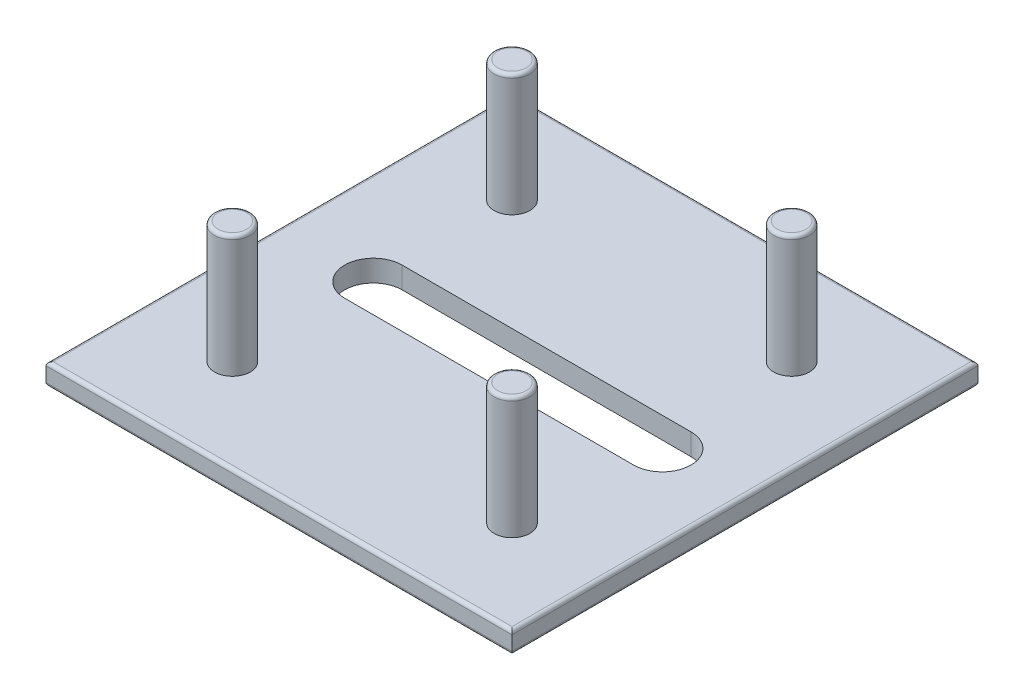
ISO-10303-21;
HEADER;
FILE_DESCRIPTION(('STEP AP214'),'2;1');
FILE_NAME('part.step','',(''),(''),'','','');
FILE_SCHEMA(('AUTOMOTIVE_DESIGN { 1 0 10303 214 1 1 1 1 }'));
ENDSEC;
DATA;
#1=APPLICATION_CONTEXT('core data for automotive mechanical design processes');
#2=APPLICATION_PROTOCOL_DEFINITION('international standard','automotive_design',2000,#1);
#3=PRODUCT_CONTEXT('',#1,'mechanical');
#4=PRODUCT('Part','Part','',(#3));
#5=PRODUCT_RELATED_PRODUCT_CATEGORY('part','',(#4));
#6=PRODUCT_DEFINITION_FORMATION('','',#4);
#7=PRODUCT_DEFINITION_CONTEXT('part definition',#1,'design');
#8=PRODUCT_DEFINITION('design','',#6,#7);
#9=PRODUCT_DEFINITION_SHAPE('','',#8);
#10=(LENGTH_UNIT() NAMED_UNIT(*) SI_UNIT(.MILLI.,.METRE.));
#11=(NAMED_UNIT(*) PLANE_ANGLE_UNIT() SI_UNIT($,.RADIAN.));
#12=(NAMED_UNIT(*) SI_UNIT($,.STERADIAN.) SOLID_ANGLE_UNIT());
#13=UNCERTAINTY_MEASURE_WITH_UNIT(LENGTH_MEASURE(1.E-05),#10,'distance_accuracy_value','');
#14=(GEOMETRIC_REPRESENTATION_CONTEXT(3) GLOBAL_UNCERTAINTY_ASSIGNED_CONTEXT((#13)) GLOBAL_UNIT_ASSIGNED_CONTEXT((#10,
#11,#12)) REPRESENTATION_CONTEXT('',''));
#15=CARTESIAN_POINT('',(0.,0.,0.));
#16=DIRECTION('',(0.,0.,1.));
#17=DIRECTION('',(1.,0.,0.));
#18=AXIS2_PLACEMENT_3D('',#15,#16,#17);
#19=CARTESIAN_POINT('',(32.5,3.,-32.5));
#20=DIRECTION('',(-1.,0.,0.));
#21=DIRECTION('',(0.,0.,1.));
#22=AXIS2_PLACEMENT_3D('',#19,#20,#21);
#23=PLANE('',#22);
#24=DIRECTION('',(0.,-1.,0.));
#25=VECTOR('',#24,1.);
#26=CARTESIAN_POINT('',(32.5,3.,-32.5));
#27=LINE('',#26,#25);
#28=CARTESIAN_POINT('',(32.5,2.5,-32.5));
#29=VERTEX_POINT('',#28);
#30=CARTESIAN_POINT('',(32.5,0.5,-32.5));
#31=VERTEX_POINT('',#30);
#32=EDGE_CURVE('E215',#29,#31,#27,.T.);
#33=ORIENTED_EDGE('',*,*,#32,.F.);
#34=DIRECTION('',(0.,0.,-1.));
#35=VECTOR('',#34,1.);
#36=CARTESIAN_POINT('',(32.5,2.5,32.5));
#37=LINE('',#36,#35);
#38=CARTESIAN_POINT('',(32.5,2.5,32.5));
#39=VERTEX_POINT('',#38);
#40=EDGE_CURVE('E267',#29,#39,#37,.F.);
#41=ORIENTED_EDGE('',*,*,#40,.T.);
#42=DIRECTION('',(0.,-1.,0.));
#43=VECTOR('',#42,1.);
#44=CARTESIAN_POINT('',(32.5,3.,32.5));
#45=LINE('',#44,#43);
#46=CARTESIAN_POINT('',(32.5,0.5,32.5));
#47=VERTEX_POINT('',#46);
#48=EDGE_CURVE('E203',#39,#47,#45,.T.);
#49=ORIENTED_EDGE('',*,*,#48,.T.);
#50=DIRECTION('',(0.,0.,-1.));
#51=VECTOR('',#50,1.);
#52=CARTESIAN_POINT('',(32.5,0.5,-32.5));
#53=LINE('',#52,#51);
#54=EDGE_CURVE('E264',#47,#31,#53,.T.);
#55=ORIENTED_EDGE('',*,*,#54,.T.);
#56=EDGE_LOOP('',(#33,#41,#49,#55));
#57=FACE_BOUND('',#56,.T.);
#58=ADVANCED_FACE('F43',(#57),#23,.F.);
#59=CARTESIAN_POINT('',(-32.5,3.,-32.5));
#60=DIRECTION('',(0.,0.,1.));
#61=DIRECTION('',(1.,0.,0.));
#62=AXIS2_PLACEMENT_3D('',#59,#60,#61);
#63=PLANE('',#62);
#64=DIRECTION('',(0.,-1.,0.));
#65=VECTOR('',#64,1.);
#66=CARTESIAN_POINT('',(-32.5,3.,-32.5));
#67=LINE('',#66,#65);
#68=CARTESIAN_POINT('',(-32.5,2.5,-32.5));
#69=VERTEX_POINT('',#68);
#70=CARTESIAN_POINT('',(-32.5,0.5,-32.5));
#71=VERTEX_POINT('',#70);
#72=EDGE_CURVE('E211',#69,#71,#67,.T.);
#73=ORIENTED_EDGE('',*,*,#72,.F.);
#74=DIRECTION('',(-1.,0.,0.));
#75=VECTOR('',#74,1.);
#76=CARTESIAN_POINT('',(32.5,2.5,-32.5));
#77=LINE('',#76,#75);
#78=EDGE_CURVE('E275',#69,#29,#77,.F.);
#79=ORIENTED_EDGE('',*,*,#78,.T.);
#80=ORIENTED_EDGE('',*,*,#32,.T.);
#81=DIRECTION('',(-1.,0.,0.));
#82=VECTOR('',#81,1.);
#83=CARTESIAN_POINT('',(-32.5,0.5,-32.5));
#84=LINE('',#83,#82);
#85=EDGE_CURVE('E271',#31,#71,#84,.T.);
#86=ORIENTED_EDGE('',*,*,#85,.T.);
#87=EDGE_LOOP('',(#73,#79,#80,#86));
#88=FACE_BOUND('',#87,.T.);
#89=ADVANCED_FACE('F338',(#88),#63,.F.);
#90=CARTESIAN_POINT('',(-32.5,3.,-32.5));
#91=DIRECTION('',(1.,0.,0.));
#92=DIRECTION('',(0.,0.,-1.));
#93=AXIS2_PLACEMENT_3D('',#90,#91,#92);
#94=PLANE('',#93);
#95=DIRECTION('',(0.,-1.,0.));
#96=VECTOR('',#95,1.);
#97=CARTESIAN_POINT('',(-32.5,3.,32.5));
#98=LINE('',#97,#96);
#99=CARTESIAN_POINT('',(-32.5,2.5,32.5));
#100=VERTEX_POINT('',#99);
#101=CARTESIAN_POINT('',(-32.5,0.5,32.5));
#102=VERTEX_POINT('',#101);
#103=EDGE_CURVE('E207',#100,#102,#98,.T.);
#104=ORIENTED_EDGE('',*,*,#103,.F.);
#105=DIRECTION('',(0.,0.,1.));
#106=VECTOR('',#105,1.);
#107=CARTESIAN_POINT('',(-32.5,2.5,-32.5));
#108=LINE('',#107,#106);
#109=EDGE_CURVE('E287',#100,#69,#108,.F.);
#110=ORIENTED_EDGE('',*,*,#109,.T.);
#111=ORIENTED_EDGE('',*,*,#72,.T.);
#112=DIRECTION('',(0.,0.,1.));
#113=VECTOR('',#112,1.);
#114=CARTESIAN_POINT('',(-32.5,0.5,-32.5));
#115=LINE('',#114,#113);
#116=EDGE_CURVE('E284',#71,#102,#115,.T.);
#117=ORIENTED_EDGE('',*,*,#116,.T.);
#118=EDGE_LOOP('',(#104,#110,#111,#117));
#119=FACE_BOUND('',#118,.T.);
#120=ADVANCED_FACE('F341',(#119),#94,.F.);
#121=CARTESIAN_POINT('',(-32.5,3.,32.5));
#122=DIRECTION('',(0.,0.,-1.));
#123=DIRECTION('',(-1.,0.,0.));
#124=AXIS2_PLACEMENT_3D('',#121,#122,#123);
#125=PLANE('',#124);
#126=ORIENTED_EDGE('',*,*,#48,.F.);
#127=DIRECTION('',(1.,0.,0.));
#128=VECTOR('',#127,1.);
#129=CARTESIAN_POINT('',(-32.5,2.5,32.5));
#130=LINE('',#129,#128);
#131=EDGE_CURVE('E281',#39,#100,#130,.F.);
#132=ORIENTED_EDGE('',*,*,#131,.T.);
#133=ORIENTED_EDGE('',*,*,#103,.T.);
#134=DIRECTION('',(1.,0.,0.));
#135=VECTOR('',#134,1.);
#136=CARTESIAN_POINT('',(-32.5,0.5,32.5));
#137=LINE('',#136,#135);
#138=EDGE_CURVE('E278',#102,#47,#137,.T.);
#139=ORIENTED_EDGE('',*,*,#138,.T.);
#140=EDGE_LOOP('',(#126,#132,#133,#139));
#141=FACE_BOUND('',#140,.T.);
#142=ADVANCED_FACE('F430',(#141),#125,.F.);
#143=CARTESIAN_POINT('',(0.,3.,0.));
#144=DIRECTION('',(0.,1.,0.));
#145=DIRECTION('',(0.,0.,1.));
#146=AXIS2_PLACEMENT_3D('',#143,#144,#145);
#147=PLANE('',#146);
#148=DIRECTION('',(1.,0.,0.));
#149=VECTOR('',#148,1.);
#150=CARTESIAN_POINT('',(32.5,3.,32.));
#151=LINE('',#150,#149);
#152=CARTESIAN_POINT('',(-32.,3.,32.));
#153=VERTEX_POINT('',#152);
#154=CARTESIAN_POINT('',(32.,3.,32.));
#155=VERTEX_POINT('',#154);
#156=EDGE_CURVE('E254',#153,#155,#151,.T.);
#157=ORIENTED_EDGE('',*,*,#156,.T.);
#158=DIRECTION('',(0.,0.,-1.));
#159=VECTOR('',#158,1.);
#160=CARTESIAN_POINT('',(32.,3.,-32.5));
#161=LINE('',#160,#159);
#162=CARTESIAN_POINT('',(32.,3.,-32.));
#163=VERTEX_POINT('',#162);
#164=EDGE_CURVE('E260',#155,#163,#161,.T.);
#165=ORIENTED_EDGE('',*,*,#164,.T.);
#166=DIRECTION('',(-1.,0.,0.));
#167=VECTOR('',#166,1.);
#168=CARTESIAN_POINT('',(-32.5,3.,-32.));
#169=LINE('',#168,#167);
#170=CARTESIAN_POINT('',(-32.,3.,-32.));
#171=VERTEX_POINT('',#170);
#172=EDGE_CURVE('E257',#163,#171,#169,.T.);
#173=ORIENTED_EDGE('',*,*,#172,.T.);
#174=DIRECTION('',(0.,0.,1.));
#175=VECTOR('',#174,1.);
#176=CARTESIAN_POINT('',(-32.,3.,32.5));
#177=LINE('',#176,#175);
#178=EDGE_CURVE('E251',#171,#153,#177,.T.);
#179=ORIENTED_EDGE('',*,*,#178,.T.);
#180=EDGE_LOOP('',(#157,#165,#173,#179));
#181=FACE_BOUND('',#180,.T.);
#182=CARTESIAN_POINT('',(-19.3358060086028,3.,0.));
#183=DIRECTION('',(0.,1.,0.));
#184=DIRECTION('',(0.,0.,1.));
#185=AXIS2_PLACEMENT_3D('',#182,#183,#184);
#186=CIRCLE('',#185,4.00540236187915);
#187=CARTESIAN_POINT('',(-19.3358060086028,3.,-4.00540236187915));
#188=VERTEX_POINT('',#187);
#189=CARTESIAN_POINT('',(-19.3358060086028,3.,4.00540236187915));
#190=VERTEX_POINT('',#189);
#191=EDGE_CURVE('E184',#188,#190,#186,.T.);
#192=ORIENTED_EDGE('',*,*,#191,.F.);
#193=DIRECTION('',(-1.,0.,0.));
#194=VECTOR('',#193,1.);
#195=CARTESIAN_POINT('',(0.,3.,-4.00540236187915));
#196=LINE('',#195,#194);
#197=CARTESIAN_POINT('',(20.9662409563712,3.,-4.00540236187915));
#198=VERTEX_POINT('',#197);
#199=EDGE_CURVE('E172',#198,#188,#196,.T.);
#200=ORIENTED_EDGE('',*,*,#199,.F.);
#201=CARTESIAN_POINT('',(20.9662409563712,3.,0.));
#202=DIRECTION('',(0.,1.,0.));
#203=DIRECTION('',(0.,0.,1.));
#204=AXIS2_PLACEMENT_3D('',#201,#202,#203);
#205=CIRCLE('',#204,4.00540236187915);
#206=CARTESIAN_POINT('',(20.9662409563712,3.,4.00540236187915));
#207=VERTEX_POINT('',#206);
#208=EDGE_CURVE('E143',#207,#198,#205,.T.);
#209=ORIENTED_EDGE('',*,*,#208,.F.);
#210=DIRECTION('',(1.,0.,0.));
#211=VECTOR('',#210,1.);
#212=CARTESIAN_POINT('',(0.,3.,4.00540236187915));
#213=LINE('',#212,#211);
#214=EDGE_CURVE('E181',#190,#207,#213,.T.);
#215=ORIENTED_EDGE('',*,*,#214,.F.);
#216=EDGE_LOOP('',(#192,#200,#209,#215));
#217=FACE_BOUND('',#216,.T.);
#218=CARTESIAN_POINT('',(19.5,3.,19.5));
#219=DIRECTION('',(0.,1.,0.));
#220=DIRECTION('',(0.,0.,1.));
#221=AXIS2_PLACEMENT_3D('',#218,#219,#220);
#222=CIRCLE('',#221,2.5);
#223=CARTESIAN_POINT('',(19.5,3.,22.));
#224=VERTEX_POINT('',#223);
#225=EDGE_CURVE('E187',#224,#224,#222,.T.);
#226=ORIENTED_EDGE('',*,*,#225,.F.);
#227=EDGE_LOOP('',(#226));
#228=FACE_BOUND('',#227,.T.);
#229=CARTESIAN_POINT('',(-19.5,3.,19.5));
#230=DIRECTION('',(0.,1.,0.));
#231=DIRECTION('',(0.,0.,1.));
#232=AXIS2_PLACEMENT_3D('',#229,#230,#231);
#233=CIRCLE('',#232,2.5);
#234=CARTESIAN_POINT('',(-19.5,3.,22.));
#235=VERTEX_POINT('',#234);
#236=EDGE_CURVE('E191',#235,#235,#233,.T.);
#237=ORIENTED_EDGE('',*,*,#236,.F.);
#238=EDGE_LOOP('',(#237));
#239=FACE_BOUND('',#238,.T.);
#240=CARTESIAN_POINT('',(19.5,3.,-19.5));
#241=DIRECTION('',(0.,1.,0.));
#242=DIRECTION('',(0.,0.,1.));
#243=AXIS2_PLACEMENT_3D('',#240,#241,#242);
#244=CIRCLE('',#243,2.5);
#245=CARTESIAN_POINT('',(19.5,3.,-17.));
#246=VERTEX_POINT('',#245);
#247=EDGE_CURVE('E195',#246,#246,#244,.T.);
#248=ORIENTED_EDGE('',*,*,#247,.F.);
#249=EDGE_LOOP('',(#248));
#250=FACE_BOUND('',#249,.T.);
#251=CARTESIAN_POINT('',(-19.5,3.,-19.5));
#252=DIRECTION('',(0.,1.,0.));
#253=DIRECTION('',(0.,0.,1.));
#254=AXIS2_PLACEMENT_3D('',#251,#252,#253);
#255=CIRCLE('',#254,2.5);
#256=CARTESIAN_POINT('',(-19.5,3.,-17.));
#257=VERTEX_POINT('',#256);
#258=EDGE_CURVE('E199',#257,#257,#255,.T.);
#259=ORIENTED_EDGE('',*,*,#258,.F.);
#260=EDGE_LOOP('',(#259));
#261=FACE_BOUND('',#260,.T.);
#262=ADVANCED_FACE('F355',(#181,#217,#228,#239,#250,#261),#147,.T.);
#263=CARTESIAN_POINT('',(0.,0.,0.));
#264=DIRECTION('',(0.,1.,0.));
#265=DIRECTION('',(0.,0.,1.));
#266=AXIS2_PLACEMENT_3D('',#263,#264,#265);
#267=PLANE('',#266);
#268=DIRECTION('',(0.,0.,1.));
#269=VECTOR('',#268,1.);
#270=CARTESIAN_POINT('',(-32.,0.,0.));
#271=LINE('',#270,#269);
#272=CARTESIAN_POINT('',(-32.,0.,32.));
#273=VERTEX_POINT('',#272);
#274=CARTESIAN_POINT('',(-32.,0.,-32.));
#275=VERTEX_POINT('',#274);
#276=EDGE_CURVE('E290',#273,#275,#271,.F.);
#277=ORIENTED_EDGE('',*,*,#276,.T.);
#278=DIRECTION('',(-1.,0.,0.));
#279=VECTOR('',#278,1.);
#280=CARTESIAN_POINT('',(0.,0.,-32.));
#281=LINE('',#280,#279);
#282=CARTESIAN_POINT('',(32.,0.,-32.));
#283=VERTEX_POINT('',#282);
#284=EDGE_CURVE('E11',#275,#283,#281,.F.);
#285=ORIENTED_EDGE('',*,*,#284,.T.);
#286=DIRECTION('',(0.,0.,-1.));
#287=VECTOR('',#286,1.);
#288=CARTESIAN_POINT('',(32.,0.,0.));
#289=LINE('',#288,#287);
#290=CARTESIAN_POINT('',(32.,0.,32.));
#291=VERTEX_POINT('',#290);
#292=EDGE_CURVE('E53',#283,#291,#289,.F.);
#293=ORIENTED_EDGE('',*,*,#292,.T.);
#294=DIRECTION('',(1.,0.,0.));
#295=VECTOR('',#294,1.);
#296=CARTESIAN_POINT('',(0.,0.,32.));
#297=LINE('',#296,#295);
#298=EDGE_CURVE('E293',#291,#273,#297,.F.);
#299=ORIENTED_EDGE('',*,*,#298,.T.);
#300=EDGE_LOOP('',(#277,#285,#293,#299));
#301=FACE_BOUND('',#300,.T.);
#302=DIRECTION('',(1.,0.,0.));
#303=VECTOR('',#302,1.);
#304=CARTESIAN_POINT('',(-19.3358060086028,0.,-4.00540236187915));
#305=LINE('',#304,#303);
#306=CARTESIAN_POINT('',(-19.3358060086028,0.,-4.00540236187915));
#307=VERTEX_POINT('',#306);
#308=CARTESIAN_POINT('',(20.9662409563712,0.,-4.00540236187915));
#309=VERTEX_POINT('',#308);
#310=EDGE_CURVE('E152',#307,#309,#305,.T.);
#311=ORIENTED_EDGE('',*,*,#310,.F.);
#312=CARTESIAN_POINT('',(-19.3358060086028,0.,0.));
#313=DIRECTION('',(0.,-1.,0.));
#314=DIRECTION('',(0.,0.,-1.));
#315=AXIS2_PLACEMENT_3D('',#312,#313,#314);
#316=CIRCLE('',#315,4.00540236187915);
#317=CARTESIAN_POINT('',(-19.3358060086028,0.,4.00540236187915));
#318=VERTEX_POINT('',#317);
#319=EDGE_CURVE('E158',#318,#307,#316,.T.);
#320=ORIENTED_EDGE('',*,*,#319,.F.);
#321=DIRECTION('',(-1.,0.,0.));
#322=VECTOR('',#321,1.);
#323=CARTESIAN_POINT('',(-19.3358060086028,0.,4.00540236187915));
#324=LINE('',#323,#322);
#325=CARTESIAN_POINT('',(20.9662409563712,0.,4.00540236187915));
#326=VERTEX_POINT('',#325);
#327=EDGE_CURVE('E162',#326,#318,#324,.T.);
#328=ORIENTED_EDGE('',*,*,#327,.F.);
#329=CARTESIAN_POINT('',(20.9662409563712,0.,0.));
#330=DIRECTION('',(0.,-1.,0.));
#331=DIRECTION('',(0.,0.,-1.));
#332=AXIS2_PLACEMENT_3D('',#329,#330,#331);
#333=CIRCLE('',#332,4.00540236187915);
#334=EDGE_CURVE('E140',#309,#326,#333,.T.);
#335=ORIENTED_EDGE('',*,*,#334,.F.);
#336=EDGE_LOOP('',(#311,#320,#328,#335));
#337=FACE_BOUND('',#336,.T.);
#338=ADVANCED_FACE('F160',(#301,#337),#267,.F.);
#339=CARTESIAN_POINT('',(-19.5,20.,-19.5));
#340=DIRECTION('',(0.,-1.,0.));
#341=DIRECTION('',(0.,0.,-1.));
#342=AXIS2_PLACEMENT_3D('',#339,#340,#341);
#343=CYLINDRICAL_SURFACE('',#342,2.5);
#344=CARTESIAN_POINT('',(-19.5,19.5,-19.5));
#345=DIRECTION('',(0.,1.,0.));
#346=DIRECTION('',(0.,0.,1.));
#347=AXIS2_PLACEMENT_3D('',#344,#345,#346);
#348=CIRCLE('',#347,2.5);
#349=CARTESIAN_POINT('',(-19.5,19.5,-17.));
#350=VERTEX_POINT('',#349);
#351=EDGE_CURVE('E239',#350,#350,#348,.F.);
#352=ORIENTED_EDGE('',*,*,#351,.T.);
#353=EDGE_LOOP('',(#352));
#354=FACE_BOUND('',#353,.T.);
#355=ORIENTED_EDGE('',*,*,#258,.T.);
#356=EDGE_LOOP('',(#355));
#357=FACE_BOUND('',#356,.T.);
#358=ADVANCED_FACE('F423',(#354,#357),#343,.T.);
#359=CARTESIAN_POINT('',(-19.5,20.,-19.5));
#360=DIRECTION('',(0.,1.,0.));
#361=DIRECTION('',(0.,0.,1.));
#362=AXIS2_PLACEMENT_3D('',#359,#360,#361);
#363=PLANE('',#362);
#364=CARTESIAN_POINT('',(-19.5,20.,-19.5));
#365=DIRECTION('',(0.,1.,0.));
#366=DIRECTION('',(0.,0.,1.));
#367=AXIS2_PLACEMENT_3D('',#364,#365,#366);
#368=CIRCLE('',#367,2.);
#369=CARTESIAN_POINT('',(-19.5,20.,-17.5));
#370=VERTEX_POINT('',#369);
#371=EDGE_CURVE('E235',#370,#370,#368,.T.);
#372=ORIENTED_EDGE('',*,*,#371,.T.);
#373=EDGE_LOOP('',(#372));
#374=FACE_BOUND('',#373,.T.);
#375=ADVANCED_FACE('F416',(#374),#363,.T.);
#376=CARTESIAN_POINT('',(19.5,20.,-19.5));
#377=DIRECTION('',(0.,-1.,0.));
#378=DIRECTION('',(0.,0.,-1.));
#379=AXIS2_PLACEMENT_3D('',#376,#377,#378);
#380=CYLINDRICAL_SURFACE('',#379,2.5);
#381=CARTESIAN_POINT('',(19.5,19.5,-19.5));
#382=DIRECTION('',(0.,1.,0.));
#383=DIRECTION('',(0.,0.,1.));
#384=AXIS2_PLACEMENT_3D('',#381,#382,#383);
#385=CIRCLE('',#384,2.5);
#386=CARTESIAN_POINT('',(19.5,19.5,-17.));
#387=VERTEX_POINT('',#386);
#388=EDGE_CURVE('E247',#387,#387,#385,.F.);
#389=ORIENTED_EDGE('',*,*,#388,.T.);
#390=EDGE_LOOP('',(#389));
#391=FACE_BOUND('',#390,.T.);
#392=ORIENTED_EDGE('',*,*,#247,.T.);
#393=EDGE_LOOP('',(#392));
#394=FACE_BOUND('',#393,.T.);
#395=ADVANCED_FACE('F407',(#391,#394),#380,.T.);
#396=CARTESIAN_POINT('',(19.5,20.,-19.5));
#397=DIRECTION('',(0.,1.,0.));
#398=DIRECTION('',(0.,0.,1.));
#399=AXIS2_PLACEMENT_3D('',#396,#397,#398);
#400=PLANE('',#399);
#401=CARTESIAN_POINT('',(19.5,20.,-19.5));
#402=DIRECTION('',(0.,1.,0.));
#403=DIRECTION('',(0.,0.,1.));
#404=AXIS2_PLACEMENT_3D('',#401,#402,#403);
#405=CIRCLE('',#404,2.);
#406=CARTESIAN_POINT('',(19.5,20.,-17.5));
#407=VERTEX_POINT('',#406);
#408=EDGE_CURVE('E243',#407,#407,#405,.T.);
#409=ORIENTED_EDGE('',*,*,#408,.T.);
#410=EDGE_LOOP('',(#409));
#411=FACE_BOUND('',#410,.T.);
#412=ADVANCED_FACE('F404',(#411),#400,.T.);
#413=CARTESIAN_POINT('',(-19.5,20.,19.5));
#414=DIRECTION('',(0.,-1.,0.));
#415=DIRECTION('',(0.,0.,-1.));
#416=AXIS2_PLACEMENT_3D('',#413,#414,#415);
#417=CYLINDRICAL_SURFACE('',#416,2.5);
#418=CARTESIAN_POINT('',(-19.5,19.5,19.5));
#419=DIRECTION('',(0.,1.,0.));
#420=DIRECTION('',(0.,0.,1.));
#421=AXIS2_PLACEMENT_3D('',#418,#419,#420);
#422=CIRCLE('',#421,2.5);
#423=CARTESIAN_POINT('',(-19.5,19.5,22.));
#424=VERTEX_POINT('',#423);
#425=EDGE_CURVE('E231',#424,#424,#422,.F.);
#426=ORIENTED_EDGE('',*,*,#425,.T.);
#427=EDGE_LOOP('',(#426));
#428=FACE_BOUND('',#427,.T.);
#429=ORIENTED_EDGE('',*,*,#236,.T.);
#430=EDGE_LOOP('',(#429));
#431=FACE_BOUND('',#430,.T.);
#432=ADVANCED_FACE('F406',(#428,#431),#417,.T.);
#433=CARTESIAN_POINT('',(-19.5,20.,19.5));
#434=DIRECTION('',(0.,1.,0.));
#435=DIRECTION('',(0.,0.,1.));
#436=AXIS2_PLACEMENT_3D('',#433,#434,#435);
#437=PLANE('',#436);
#438=CARTESIAN_POINT('',(-19.5,20.,19.5));
#439=DIRECTION('',(0.,1.,0.));
#440=DIRECTION('',(0.,0.,1.));
#441=AXIS2_PLACEMENT_3D('',#438,#439,#440);
#442=CIRCLE('',#441,2.);
#443=CARTESIAN_POINT('',(-19.5,20.,21.5));
#444=VERTEX_POINT('',#443);
#445=EDGE_CURVE('E227',#444,#444,#442,.T.);
#446=ORIENTED_EDGE('',*,*,#445,.T.);
#447=EDGE_LOOP('',(#446));
#448=FACE_BOUND('',#447,.T.);
#449=ADVANCED_FACE('F413',(#448),#437,.T.);
#450=CARTESIAN_POINT('',(19.5,20.,19.5));
#451=DIRECTION('',(0.,-1.,0.));
#452=DIRECTION('',(0.,0.,-1.));
#453=AXIS2_PLACEMENT_3D('',#450,#451,#452);
#454=CYLINDRICAL_SURFACE('',#453,2.5);
#455=CARTESIAN_POINT('',(19.5,19.5,19.5));
#456=DIRECTION('',(0.,1.,0.));
#457=DIRECTION('',(0.,0.,1.));
#458=AXIS2_PLACEMENT_3D('',#455,#456,#457);
#459=CIRCLE('',#458,2.5);
#460=CARTESIAN_POINT('',(19.5,19.5,22.));
#461=VERTEX_POINT('',#460);
#462=EDGE_CURVE('E223',#461,#461,#459,.F.);
#463=ORIENTED_EDGE('',*,*,#462,.T.);
#464=EDGE_LOOP('',(#463));
#465=FACE_BOUND('',#464,.T.);
#466=ORIENTED_EDGE('',*,*,#225,.T.);
#467=EDGE_LOOP('',(#466));
#468=FACE_BOUND('',#467,.T.);
#469=ADVANCED_FACE('F486',(#465,#468),#454,.T.);
#470=CARTESIAN_POINT('',(19.5,20.,19.5));
#471=DIRECTION('',(0.,1.,0.));
#472=DIRECTION('',(0.,0.,1.));
#473=AXIS2_PLACEMENT_3D('',#470,#471,#472);
#474=PLANE('',#473);
#475=CARTESIAN_POINT('',(19.5,20.,19.5));
#476=DIRECTION('',(0.,1.,0.));
#477=DIRECTION('',(0.,0.,1.));
#478=AXIS2_PLACEMENT_3D('',#475,#476,#477);
#479=CIRCLE('',#478,2.);
#480=CARTESIAN_POINT('',(19.5,20.,21.5));
#481=VERTEX_POINT('',#480);
#482=EDGE_CURVE('E219',#481,#481,#479,.T.);
#483=ORIENTED_EDGE('',*,*,#482,.T.);
#484=EDGE_LOOP('',(#483));
#485=FACE_BOUND('',#484,.T.);
#486=ADVANCED_FACE('F496',(#485),#474,.T.);
#487=CARTESIAN_POINT('',(-19.3358060086028,20.,0.));
#488=DIRECTION('',(0.,-1.,0.));
#489=DIRECTION('',(0.,0.,-1.));
#490=AXIS2_PLACEMENT_3D('',#487,#488,#489);
#491=CYLINDRICAL_SURFACE('',#490,4.00540236187915);
#492=ORIENTED_EDGE('',*,*,#191,.T.);
#493=DIRECTION('',(0.,-1.,0.));
#494=VECTOR('',#493,1.);
#495=CARTESIAN_POINT('',(-19.3358060086028,20.,4.00540236187915));
#496=LINE('',#495,#494);
#497=EDGE_CURVE('E169',#190,#318,#496,.T.);
#498=ORIENTED_EDGE('',*,*,#497,.T.);
#499=ORIENTED_EDGE('',*,*,#319,.T.);
#500=DIRECTION('',(0.,-1.,0.));
#501=VECTOR('',#500,1.);
#502=CARTESIAN_POINT('',(-19.3358060086028,20.,-4.00540236187915));
#503=LINE('',#502,#501);
#504=EDGE_CURVE('E148',#188,#307,#503,.T.);
#505=ORIENTED_EDGE('',*,*,#504,.F.);
#506=EDGE_LOOP('',(#492,#498,#499,#505));
#507=FACE_BOUND('',#506,.T.);
#508=ADVANCED_FACE('F507',(#507),#491,.F.);
#509=CARTESIAN_POINT('',(-19.3358060086028,20.,4.00540236187915));
#510=DIRECTION('',(0.,0.,1.));
#511=DIRECTION('',(1.,0.,0.));
#512=AXIS2_PLACEMENT_3D('',#509,#510,#511);
#513=PLANE('',#512);
#514=ORIENTED_EDGE('',*,*,#214,.T.);
#515=DIRECTION('',(0.,-1.,0.));
#516=VECTOR('',#515,1.);
#517=CARTESIAN_POINT('',(20.9662409563712,20.,4.00540236187915));
#518=LINE('',#517,#516);
#519=EDGE_CURVE('E147',#207,#326,#518,.T.);
#520=ORIENTED_EDGE('',*,*,#519,.T.);
#521=ORIENTED_EDGE('',*,*,#327,.T.);
#522=ORIENTED_EDGE('',*,*,#497,.F.);
#523=EDGE_LOOP('',(#514,#520,#521,#522));
#524=FACE_BOUND('',#523,.T.);
#525=ADVANCED_FACE('F627',(#524),#513,.F.);
#526=CARTESIAN_POINT('',(20.9662409563712,20.,0.));
#527=DIRECTION('',(0.,-1.,0.));
#528=DIRECTION('',(0.,0.,-1.));
#529=AXIS2_PLACEMENT_3D('',#526,#527,#528);
#530=CYLINDRICAL_SURFACE('',#529,4.00540236187915);
#531=ORIENTED_EDGE('',*,*,#208,.T.);
#532=DIRECTION('',(0.,-1.,0.));
#533=VECTOR('',#532,1.);
#534=CARTESIAN_POINT('',(20.9662409563712,20.,-4.00540236187915));
#535=LINE('',#534,#533);
#536=EDGE_CURVE('E135',#198,#309,#535,.T.);
#537=ORIENTED_EDGE('',*,*,#536,.T.);
#538=ORIENTED_EDGE('',*,*,#334,.T.);
#539=ORIENTED_EDGE('',*,*,#519,.F.);
#540=EDGE_LOOP('',(#531,#537,#538,#539));
#541=FACE_BOUND('',#540,.T.);
#542=ADVANCED_FACE('F137',(#541),#530,.F.);
#543=CARTESIAN_POINT('',(-19.3358060086028,20.,-4.00540236187915));
#544=DIRECTION('',(0.,0.,-1.));
#545=DIRECTION('',(-1.,0.,0.));
#546=AXIS2_PLACEMENT_3D('',#543,#544,#545);
#547=PLANE('',#546);
#548=ORIENTED_EDGE('',*,*,#199,.T.);
#549=ORIENTED_EDGE('',*,*,#504,.T.);
#550=ORIENTED_EDGE('',*,*,#310,.T.);
#551=ORIENTED_EDGE('',*,*,#536,.F.);
#552=EDGE_LOOP('',(#548,#549,#550,#551));
#553=FACE_BOUND('',#552,.T.);
#554=ADVANCED_FACE('F153',(#553),#547,.F.);
#555=CARTESIAN_POINT('',(19.5,19.5,19.5));
#556=DIRECTION('',(0.,1.,0.));
#557=DIRECTION('',(0.,0.,1.));
#558=AXIS2_PLACEMENT_3D('',#555,#556,#557);
#559=TOROIDAL_SURFACE('',#558,2.,0.5);
#560=ORIENTED_EDGE('',*,*,#462,.F.);
#561=EDGE_LOOP('',(#560));
#562=FACE_BOUND('',#561,.T.);
#563=ORIENTED_EDGE('',*,*,#482,.F.);
#564=EDGE_LOOP('',(#563));
#565=FACE_BOUND('',#564,.T.);
#566=ADVANCED_FACE('F382',(#562,#565),#559,.T.);
#567=CARTESIAN_POINT('',(-19.5,19.5,19.5));
#568=DIRECTION('',(0.,1.,0.));
#569=DIRECTION('',(0.,0.,1.));
#570=AXIS2_PLACEMENT_3D('',#567,#568,#569);
#571=TOROIDAL_SURFACE('',#570,2.,0.5);
#572=ORIENTED_EDGE('',*,*,#425,.F.);
#573=EDGE_LOOP('',(#572));
#574=FACE_BOUND('',#573,.T.);
#575=ORIENTED_EDGE('',*,*,#445,.F.);
#576=EDGE_LOOP('',(#575));
#577=FACE_BOUND('',#576,.T.);
#578=ADVANCED_FACE('F385',(#574,#577),#571,.T.);
#579=CARTESIAN_POINT('',(-19.5,19.5,-19.5));
#580=DIRECTION('',(0.,1.,0.));
#581=DIRECTION('',(0.,0.,1.));
#582=AXIS2_PLACEMENT_3D('',#579,#580,#581);
#583=TOROIDAL_SURFACE('',#582,2.,0.5);
#584=ORIENTED_EDGE('',*,*,#351,.F.);
#585=EDGE_LOOP('',(#584));
#586=FACE_BOUND('',#585,.T.);
#587=ORIENTED_EDGE('',*,*,#371,.F.);
#588=EDGE_LOOP('',(#587));
#589=FACE_BOUND('',#588,.T.);
#590=ADVANCED_FACE('F389',(#586,#589),#583,.T.);
#591=CARTESIAN_POINT('',(19.5,19.5,-19.5));
#592=DIRECTION('',(0.,1.,0.));
#593=DIRECTION('',(0.,0.,1.));
#594=AXIS2_PLACEMENT_3D('',#591,#592,#593);
#595=TOROIDAL_SURFACE('',#594,2.,0.5);
#596=ORIENTED_EDGE('',*,*,#388,.F.);
#597=EDGE_LOOP('',(#596));
#598=FACE_BOUND('',#597,.T.);
#599=ORIENTED_EDGE('',*,*,#408,.F.);
#600=EDGE_LOOP('',(#599));
#601=FACE_BOUND('',#600,.T.);
#602=ADVANCED_FACE('F392',(#598,#601),#595,.T.);
#603=CARTESIAN_POINT('',(-32.,2.5,0.));
#604=DIRECTION('',(0.,0.,-1.));
#605=DIRECTION('',(-1.,0.,0.));
#606=AXIS2_PLACEMENT_3D('',#603,#604,#605);
#607=CYLINDRICAL_SURFACE('',#606,0.5);
#608=CARTESIAN_POINT('',(-32.,2.5,-32.));
#609=DIRECTION('',(0.707106781186547,0.,-0.707106781186548));
#610=DIRECTION('',(-0.707106781186547,0.,-0.707106781186547));
#611=AXIS2_PLACEMENT_3D('',#608,#609,#610);
#612=ELLIPSE('',#611,0.707106781186548,0.5);
#613=EDGE_CURVE('E304',#69,#171,#612,.T.);
#614=ORIENTED_EDGE('',*,*,#613,.F.);
#615=ORIENTED_EDGE('',*,*,#109,.F.);
#616=CARTESIAN_POINT('',(-32.,2.5,32.));
#617=DIRECTION('',(-0.707106781186547,0.,-0.707106781186547));
#618=DIRECTION('',(0.707106781186547,0.,-0.707106781186548));
#619=AXIS2_PLACEMENT_3D('',#616,#617,#618);
#620=ELLIPSE('',#619,0.707106781186547,0.5);
#621=EDGE_CURVE('E308',#153,#100,#620,.F.);
#622=ORIENTED_EDGE('',*,*,#621,.F.);
#623=ORIENTED_EDGE('',*,*,#178,.F.);
#624=EDGE_LOOP('',(#614,#615,#622,#623));
#625=FACE_BOUND('',#624,.T.);
#626=ADVANCED_FACE('F345',(#625),#607,.T.);
#627=CARTESIAN_POINT('',(0.,2.5,32.));
#628=DIRECTION('',(-1.,0.,0.));
#629=DIRECTION('',(0.,0.,1.));
#630=AXIS2_PLACEMENT_3D('',#627,#628,#629);
#631=CYLINDRICAL_SURFACE('',#630,0.5);
#632=ORIENTED_EDGE('',*,*,#621,.T.);
#633=ORIENTED_EDGE('',*,*,#131,.F.);
#634=CARTESIAN_POINT('',(32.,2.5,32.));
#635=DIRECTION('',(-0.707106781186547,0.,0.707106781186548));
#636=DIRECTION('',(-0.707106781186548,0.,-0.707106781186547));
#637=AXIS2_PLACEMENT_3D('',#634,#635,#636);
#638=ELLIPSE('',#637,0.707106781186548,0.5);
#639=EDGE_CURVE('E301',#155,#39,#638,.F.);
#640=ORIENTED_EDGE('',*,*,#639,.F.);
#641=ORIENTED_EDGE('',*,*,#156,.F.);
#642=EDGE_LOOP('',(#632,#633,#640,#641));
#643=FACE_BOUND('',#642,.T.);
#644=ADVANCED_FACE('F351',(#643),#631,.T.);
#645=CARTESIAN_POINT('',(0.,2.5,-32.));
#646=DIRECTION('',(1.,0.,0.));
#647=DIRECTION('',(0.,0.,-1.));
#648=AXIS2_PLACEMENT_3D('',#645,#646,#647);
#649=CYLINDRICAL_SURFACE('',#648,0.5);
#650=ORIENTED_EDGE('',*,*,#613,.T.);
#651=ORIENTED_EDGE('',*,*,#172,.F.);
#652=CARTESIAN_POINT('',(32.,2.5,-32.));
#653=DIRECTION('',(0.707106781186548,0.,0.707106781186547));
#654=DIRECTION('',(0.707106781186547,0.,-0.707106781186548));
#655=AXIS2_PLACEMENT_3D('',#652,#653,#654);
#656=ELLIPSE('',#655,0.707106781186547,0.5);
#657=EDGE_CURVE('E298',#29,#163,#656,.T.);
#658=ORIENTED_EDGE('',*,*,#657,.F.);
#659=ORIENTED_EDGE('',*,*,#78,.F.);
#660=EDGE_LOOP('',(#650,#651,#658,#659));
#661=FACE_BOUND('',#660,.T.);
#662=ADVANCED_FACE('F359',(#661),#649,.T.);
#663=CARTESIAN_POINT('',(32.,2.5,0.));
#664=DIRECTION('',(0.,0.,1.));
#665=DIRECTION('',(1.,0.,0.));
#666=AXIS2_PLACEMENT_3D('',#663,#664,#665);
#667=CYLINDRICAL_SURFACE('',#666,0.5);
#668=ORIENTED_EDGE('',*,*,#639,.T.);
#669=ORIENTED_EDGE('',*,*,#40,.F.);
#670=ORIENTED_EDGE('',*,*,#657,.T.);
#671=ORIENTED_EDGE('',*,*,#164,.F.);
#672=EDGE_LOOP('',(#668,#669,#670,#671));
#673=FACE_BOUND('',#672,.T.);
#674=ADVANCED_FACE('F365',(#673),#667,.T.);
#675=CARTESIAN_POINT('',(-32.5,0.5,32.));
#676=DIRECTION('',(1.,0.,0.));
#677=DIRECTION('',(0.,0.,-1.));
#678=AXIS2_PLACEMENT_3D('',#675,#676,#677);
#679=CYLINDRICAL_SURFACE('',#678,0.5);
#680=CARTESIAN_POINT('',(-32.,0.5,32.));
#681=DIRECTION('',(0.707106781186547,0.,0.707106781186547));
#682=DIRECTION('',(-0.707106781186547,0.,0.707106781186548));
#683=AXIS2_PLACEMENT_3D('',#680,#681,#682);
#684=ELLIPSE('',#683,0.707106781186547,0.5);
#685=EDGE_CURVE('E316',#273,#102,#684,.F.);
#686=ORIENTED_EDGE('',*,*,#685,.F.);
#687=ORIENTED_EDGE('',*,*,#298,.F.);
#688=CARTESIAN_POINT('',(32.,0.5,32.));
#689=DIRECTION('',(0.707106781186547,0.,-0.707106781186548));
#690=DIRECTION('',(0.707106781186548,0.,0.707106781186547));
#691=AXIS2_PLACEMENT_3D('',#688,#689,#690);
#692=ELLIPSE('',#691,0.707106781186548,0.5);
#693=EDGE_CURVE('E47',#47,#291,#692,.T.);
#694=ORIENTED_EDGE('',*,*,#693,.F.);
#695=ORIENTED_EDGE('',*,*,#138,.F.);
#696=EDGE_LOOP('',(#686,#687,#694,#695));
#697=FACE_BOUND('',#696,.T.);
#698=ADVANCED_FACE('F45',(#697),#679,.T.);
#699=CARTESIAN_POINT('',(32.,0.5,-32.5));
#700=DIRECTION('',(0.,0.,-1.));
#701=DIRECTION('',(-1.,0.,0.));
#702=AXIS2_PLACEMENT_3D('',#699,#700,#701);
#703=CYLINDRICAL_SURFACE('',#702,0.5);
#704=ORIENTED_EDGE('',*,*,#693,.T.);
#705=ORIENTED_EDGE('',*,*,#292,.F.);
#706=CARTESIAN_POINT('',(32.,0.5,-32.));
#707=DIRECTION('',(-0.707106781186548,0.,-0.707106781186547));
#708=DIRECTION('',(0.707106781186547,0.,-0.707106781186548));
#709=AXIS2_PLACEMENT_3D('',#706,#707,#708);
#710=ELLIPSE('',#709,0.707106781186547,0.5);
#711=EDGE_CURVE('E61',#31,#283,#710,.T.);
#712=ORIENTED_EDGE('',*,*,#711,.F.);
#713=ORIENTED_EDGE('',*,*,#54,.F.);
#714=EDGE_LOOP('',(#704,#705,#712,#713));
#715=FACE_BOUND('',#714,.T.);
#716=ADVANCED_FACE('F328',(#715),#703,.T.);
#717=CARTESIAN_POINT('',(-32.,0.5,-32.5));
#718=DIRECTION('',(0.,0.,1.));
#719=DIRECTION('',(1.,0.,0.));
#720=AXIS2_PLACEMENT_3D('',#717,#718,#719);
#721=CYLINDRICAL_SURFACE('',#720,0.5);
#722=ORIENTED_EDGE('',*,*,#685,.T.);
#723=ORIENTED_EDGE('',*,*,#116,.F.);
#724=CARTESIAN_POINT('',(-32.,0.5,-32.));
#725=DIRECTION('',(-0.707106781186547,0.,0.707106781186548));
#726=DIRECTION('',(0.707106781186547,0.,0.707106781186547));
#727=AXIS2_PLACEMENT_3D('',#724,#725,#726);
#728=ELLIPSE('',#727,0.707106781186548,0.5);
#729=EDGE_CURVE('E312',#275,#71,#728,.F.);
#730=ORIENTED_EDGE('',*,*,#729,.F.);
#731=ORIENTED_EDGE('',*,*,#276,.F.);
#732=EDGE_LOOP('',(#722,#723,#730,#731));
#733=FACE_BOUND('',#732,.T.);
#734=ADVANCED_FACE('F333',(#733),#721,.T.);
#735=CARTESIAN_POINT('',(-32.5,0.5,-32.));
#736=DIRECTION('',(-1.,0.,0.));
#737=DIRECTION('',(0.,0.,1.));
#738=AXIS2_PLACEMENT_3D('',#735,#736,#737);
#739=CYLINDRICAL_SURFACE('',#738,0.5);
#740=ORIENTED_EDGE('',*,*,#711,.T.);
#741=ORIENTED_EDGE('',*,*,#284,.F.);
#742=ORIENTED_EDGE('',*,*,#729,.T.);
#743=ORIENTED_EDGE('',*,*,#85,.F.);
#744=EDGE_LOOP('',(#740,#741,#742,#743));
#745=FACE_BOUND('',#744,.T.);
#746=ADVANCED_FACE('F332',(#745),#739,.T.);
#747=CLOSED_SHELL('',(#58,#89,#120,#142,#262,#338,#358,#375,#395,#412,#432,#449,#469,#486,#508,
#525,#542,#554,#566,#578,#590,#602,#626,#644,#662,#674,#698,#716,#734,#746));
#748=MANIFOLD_SOLID_BREP('B2',#747);
#749=ADVANCED_BREP_SHAPE_REPRESENTATION('',(#18,#748),#14);
#750=SHAPE_DEFINITION_REPRESENTATION(#9,#749);
ENDSEC;
END-ISO-10303-21;
